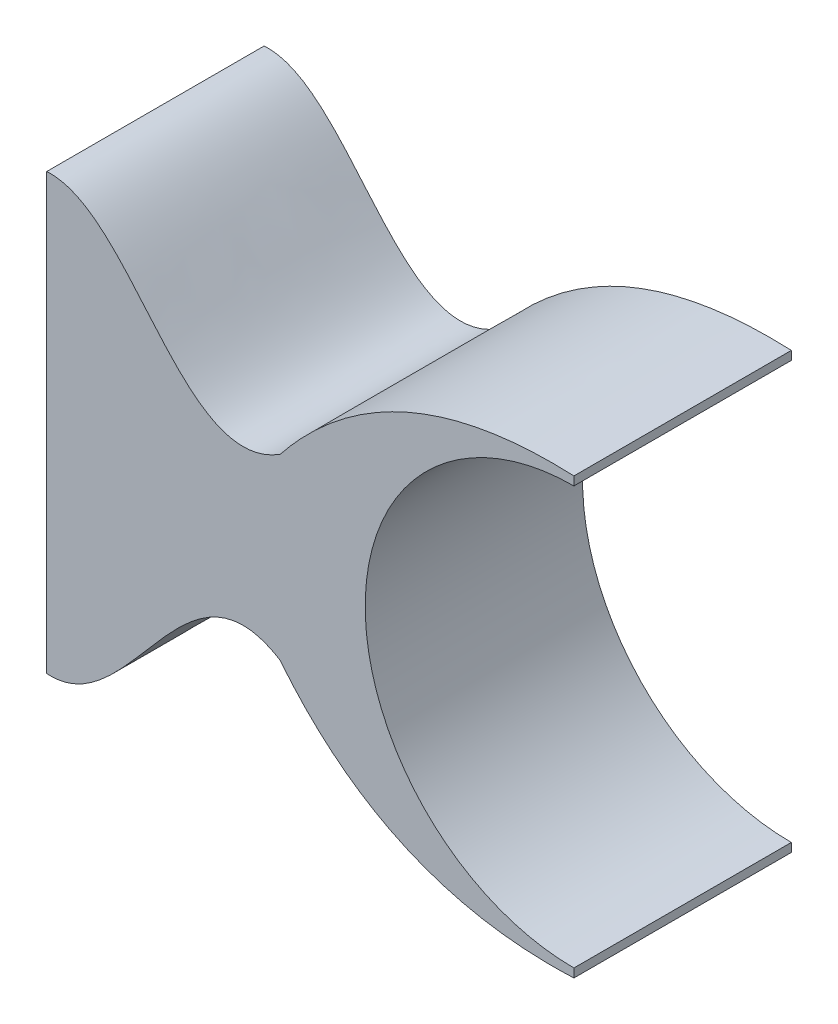
ISO-10303-21;
HEADER;
FILE_DESCRIPTION(('STEP AP214'),'2;1');
FILE_NAME('part.step','',(''),(''),'','','');
FILE_SCHEMA(('AUTOMOTIVE_DESIGN { 1 0 10303 214 1 1 1 1 }'));
ENDSEC;
DATA;
#1=APPLICATION_CONTEXT('core data for automotive mechanical design processes');
#2=APPLICATION_PROTOCOL_DEFINITION('international standard','automotive_design',2000,#1);
#3=PRODUCT_CONTEXT('',#1,'mechanical');
#4=PRODUCT('Part','Part','',(#3));
#5=PRODUCT_RELATED_PRODUCT_CATEGORY('part','',(#4));
#6=PRODUCT_DEFINITION_FORMATION('','',#4);
#7=PRODUCT_DEFINITION_CONTEXT('part definition',#1,'design');
#8=PRODUCT_DEFINITION('design','',#6,#7);
#9=PRODUCT_DEFINITION_SHAPE('','',#8);
#10=(LENGTH_UNIT() NAMED_UNIT(*) SI_UNIT(.MILLI.,.METRE.));
#11=(NAMED_UNIT(*) PLANE_ANGLE_UNIT() SI_UNIT($,.RADIAN.));
#12=(NAMED_UNIT(*) SI_UNIT($,.STERADIAN.) SOLID_ANGLE_UNIT());
#13=UNCERTAINTY_MEASURE_WITH_UNIT(LENGTH_MEASURE(1.E-05),#10,'distance_accuracy_value','');
#14=(GEOMETRIC_REPRESENTATION_CONTEXT(3) GLOBAL_UNCERTAINTY_ASSIGNED_CONTEXT((#13)) GLOBAL_UNIT_ASSIGNED_CONTEXT((#10,
#11,#12)) REPRESENTATION_CONTEXT('',''));
#15=CARTESIAN_POINT('',(0.,0.,0.));
#16=DIRECTION('',(0.,0.,1.));
#17=DIRECTION('',(1.,0.,0.));
#18=AXIS2_PLACEMENT_3D('',#15,#16,#17);
#19=CARTESIAN_POINT('',(0.,2.5,2.5));
#20=CARTESIAN_POINT('',(-2.12838134377981,2.59606487465497,2.5));
#21=CARTESIAN_POINT('',(-3.3783144735857,1.02555953711763,2.5));
#22=B_SPLINE_CURVE_WITH_KNOTS('',2,(#19,#20,#21),.UNSPECIFIED.,.F.,.F.,(3,3),(0.,1.),.UNSPECIFIED.);
#23=DIRECTION('',(0.,0.,-1.));
#24=VECTOR('',#23,1.);
#25=SURFACE_OF_LINEAR_EXTRUSION('',#22,#24);
#26=CARTESIAN_POINT('',(0.,2.5,0.));
#27=CARTESIAN_POINT('',(-2.12838134377981,2.59606487465497,0.));
#28=CARTESIAN_POINT('',(-3.3783144735857,1.02555953711763,0.));
#29=B_SPLINE_CURVE_WITH_KNOTS('',2,(#26,#27,#28),.UNSPECIFIED.,.F.,.F.,(3,3),(0.,1.),.UNSPECIFIED.);
#30=CARTESIAN_POINT('',(0.,2.5,0.));
#31=VERTEX_POINT('',#30);
#32=CARTESIAN_POINT('',(-3.3783144735857,1.02555953711763,0.));
#33=VERTEX_POINT('',#32);
#34=EDGE_CURVE('E134',#31,#33,#29,.T.);
#35=ORIENTED_EDGE('',*,*,#34,.T.);
#36=DIRECTION('',(0.,0.,-1.));
#37=VECTOR('',#36,1.);
#38=CARTESIAN_POINT('',(-3.3783144735857,1.02555953711763,2.5));
#39=LINE('',#38,#37);
#40=CARTESIAN_POINT('',(-3.3783144735857,1.02555953711763,2.5));
#41=VERTEX_POINT('',#40);
#42=EDGE_CURVE('E11',#41,#33,#39,.T.);
#43=ORIENTED_EDGE('',*,*,#42,.F.);
#44=CARTESIAN_POINT('',(0.,2.5,2.5));
#45=VERTEX_POINT('',#44);
#46=EDGE_CURVE('E168',#45,#41,#22,.T.);
#47=ORIENTED_EDGE('',*,*,#46,.F.);
#48=DIRECTION('',(0.,0.,-1.));
#49=VECTOR('',#48,1.);
#50=CARTESIAN_POINT('',(0.,2.5,2.5));
#51=LINE('',#50,#49);
#52=EDGE_CURVE('E130',#45,#31,#51,.T.);
#53=ORIENTED_EDGE('',*,*,#52,.T.);
#54=EDGE_LOOP('',(#35,#43,#47,#53));
#55=FACE_BOUND('',#54,.T.);
#56=ADVANCED_FACE('F37',(#55),#25,.F.);
#57=CARTESIAN_POINT('',(-3.3783144735857,1.02555953711763,2.5));
#58=CARTESIAN_POINT('',(-4.49216767972878,0.325238313772212,2.5));
#59=CARTESIAN_POINT('',(-5.08246023541055,2.56845581459525,2.5));
#60=CARTESIAN_POINT('',(-6.0625522393459,2.5,2.5));
#61=B_SPLINE_CURVE_WITH_KNOTS('',3,(#57,#58,#59,#60),.UNSPECIFIED.,.F.,.F.,(4,4),(0.,1.),.UNSPECIFIED.);
#62=DIRECTION('',(0.,0.,-1.));
#63=VECTOR('',#62,1.);
#64=SURFACE_OF_LINEAR_EXTRUSION('',#61,#63);
#65=CARTESIAN_POINT('',(-3.3783144735857,1.02555953711763,0.));
#66=CARTESIAN_POINT('',(-4.49216767972878,0.325238313772212,0.));
#67=CARTESIAN_POINT('',(-5.08246023541055,2.56845581459525,0.));
#68=CARTESIAN_POINT('',(-6.0625522393459,2.5,0.));
#69=B_SPLINE_CURVE_WITH_KNOTS('',3,(#65,#66,#67,#68),.UNSPECIFIED.,.F.,.F.,(4,4),(0.,1.),.UNSPECIFIED.);
#70=CARTESIAN_POINT('',(-6.0625522393459,2.5,0.));
#71=VERTEX_POINT('',#70);
#72=EDGE_CURVE('E139',#33,#71,#69,.T.);
#73=ORIENTED_EDGE('',*,*,#72,.T.);
#74=DIRECTION('',(0.,0.,-1.));
#75=VECTOR('',#74,1.);
#76=CARTESIAN_POINT('',(-6.0625522393459,2.5,2.5));
#77=LINE('',#76,#75);
#78=CARTESIAN_POINT('',(-6.0625522393459,2.5,2.5));
#79=VERTEX_POINT('',#78);
#80=EDGE_CURVE('E46',#79,#71,#77,.T.);
#81=ORIENTED_EDGE('',*,*,#80,.F.);
#82=EDGE_CURVE('E97',#41,#79,#61,.T.);
#83=ORIENTED_EDGE('',*,*,#82,.F.);
#84=ORIENTED_EDGE('',*,*,#42,.T.);
#85=EDGE_LOOP('',(#73,#81,#83,#84));
#86=FACE_BOUND('',#85,.T.);
#87=ADVANCED_FACE('F215',(#86),#64,.F.);
#88=CARTESIAN_POINT('',(-6.0625522393459,2.5,2.5));
#89=DIRECTION('',(1.,0.,0.));
#90=DIRECTION('',(0.,0.,-1.));
#91=AXIS2_PLACEMENT_3D('',#88,#89,#90);
#92=PLANE('',#91);
#93=DIRECTION('',(0.,-1.,0.));
#94=VECTOR('',#93,1.);
#95=CARTESIAN_POINT('',(-6.0625522393459,2.5,0.));
#96=LINE('',#95,#94);
#97=CARTESIAN_POINT('',(-6.0625522393459,-2.5,0.));
#98=VERTEX_POINT('',#97);
#99=EDGE_CURVE('E146',#71,#98,#96,.T.);
#100=ORIENTED_EDGE('',*,*,#99,.T.);
#101=DIRECTION('',(0.,0.,-1.));
#102=VECTOR('',#101,1.);
#103=CARTESIAN_POINT('',(-6.0625522393459,-2.5,2.5));
#104=LINE('',#103,#102);
#105=CARTESIAN_POINT('',(-6.0625522393459,-2.5,2.5));
#106=VERTEX_POINT('',#105);
#107=EDGE_CURVE('E175',#106,#98,#104,.T.);
#108=ORIENTED_EDGE('',*,*,#107,.F.);
#109=DIRECTION('',(0.,-1.,0.));
#110=VECTOR('',#109,1.);
#111=CARTESIAN_POINT('',(-6.0625522393459,2.5,2.5));
#112=LINE('',#111,#110);
#113=EDGE_CURVE('E183',#79,#106,#112,.T.);
#114=ORIENTED_EDGE('',*,*,#113,.F.);
#115=ORIENTED_EDGE('',*,*,#80,.T.);
#116=EDGE_LOOP('',(#100,#108,#114,#115));
#117=FACE_BOUND('',#116,.T.);
#118=ADVANCED_FACE('F181',(#117),#92,.F.);
#119=CARTESIAN_POINT('',(-6.0625522393459,-2.5,2.5));
#120=CARTESIAN_POINT('',(-5.08246023541055,-2.56845581459525,2.5));
#121=CARTESIAN_POINT('',(-4.49216767972878,-0.325238313772213,2.5));
#122=CARTESIAN_POINT('',(-3.3783144735857,-1.02555953711763,2.5));
#123=B_SPLINE_CURVE_WITH_KNOTS('',3,(#119,#120,#121,#122),.UNSPECIFIED.,.F.,.F.,(4,4),(0.,1.),.UNSPECIFIED.);
#124=DIRECTION('',(0.,0.,-1.));
#125=VECTOR('',#124,1.);
#126=SURFACE_OF_LINEAR_EXTRUSION('',#123,#125);
#127=CARTESIAN_POINT('',(-6.0625522393459,-2.5,0.));
#128=CARTESIAN_POINT('',(-5.08246023541055,-2.56845581459525,0.));
#129=CARTESIAN_POINT('',(-4.49216767972878,-0.325238313772213,0.));
#130=CARTESIAN_POINT('',(-3.3783144735857,-1.02555953711763,0.));
#131=B_SPLINE_CURVE_WITH_KNOTS('',3,(#127,#128,#129,#130),.UNSPECIFIED.,.F.,.F.,(4,4),(0.,1.),.UNSPECIFIED.);
#132=CARTESIAN_POINT('',(-3.3783144735857,-1.02555953711763,0.));
#133=VERTEX_POINT('',#132);
#134=EDGE_CURVE('E151',#98,#133,#131,.T.);
#135=ORIENTED_EDGE('',*,*,#134,.T.);
#136=DIRECTION('',(0.,0.,-1.));
#137=VECTOR('',#136,1.);
#138=CARTESIAN_POINT('',(-3.3783144735857,-1.02555953711763,2.5));
#139=LINE('',#138,#137);
#140=CARTESIAN_POINT('',(-3.3783144735857,-1.02555953711763,2.5));
#141=VERTEX_POINT('',#140);
#142=EDGE_CURVE('E172',#141,#133,#139,.T.);
#143=ORIENTED_EDGE('',*,*,#142,.F.);
#144=EDGE_CURVE('E195',#106,#141,#123,.T.);
#145=ORIENTED_EDGE('',*,*,#144,.F.);
#146=ORIENTED_EDGE('',*,*,#107,.T.);
#147=EDGE_LOOP('',(#135,#143,#145,#146));
#148=FACE_BOUND('',#147,.T.);
#149=ADVANCED_FACE('F191',(#148),#126,.F.);
#150=CARTESIAN_POINT('',(-3.3783144735857,-1.02555953711763,2.5));
#151=CARTESIAN_POINT('',(-2.12838134377981,-2.59606487465497,2.5));
#152=CARTESIAN_POINT('',(0.,-2.5,2.5));
#153=B_SPLINE_CURVE_WITH_KNOTS('',2,(#150,#151,#152),.UNSPECIFIED.,.F.,.F.,(3,3),(0.,1.),.UNSPECIFIED.);
#154=DIRECTION('',(0.,0.,-1.));
#155=VECTOR('',#154,1.);
#156=SURFACE_OF_LINEAR_EXTRUSION('',#153,#155);
#157=CARTESIAN_POINT('',(-3.3783144735857,-1.02555953711763,0.));
#158=CARTESIAN_POINT('',(-2.12838134377981,-2.59606487465497,0.));
#159=CARTESIAN_POINT('',(0.,-2.5,0.));
#160=B_SPLINE_CURVE_WITH_KNOTS('',2,(#157,#158,#159),.UNSPECIFIED.,.F.,.F.,(3,3),(0.,1.),.UNSPECIFIED.);
#161=CARTESIAN_POINT('',(0.,-2.5,0.));
#162=VERTEX_POINT('',#161);
#163=EDGE_CURVE('E155',#133,#162,#160,.T.);
#164=ORIENTED_EDGE('',*,*,#163,.T.);
#165=DIRECTION('',(0.,0.,-1.));
#166=VECTOR('',#165,1.);
#167=CARTESIAN_POINT('',(0.,-2.5,2.5));
#168=LINE('',#167,#166);
#169=CARTESIAN_POINT('',(0.,-2.5,2.5));
#170=VERTEX_POINT('',#169);
#171=EDGE_CURVE('E125',#170,#162,#168,.T.);
#172=ORIENTED_EDGE('',*,*,#171,.F.);
#173=EDGE_CURVE('E116',#141,#170,#153,.T.);
#174=ORIENTED_EDGE('',*,*,#173,.F.);
#175=ORIENTED_EDGE('',*,*,#142,.T.);
#176=EDGE_LOOP('',(#164,#172,#174,#175));
#177=FACE_BOUND('',#176,.T.);
#178=ADVANCED_FACE('F194',(#177),#156,.F.);
#179=CARTESIAN_POINT('',(0.,-2.5,2.5));
#180=DIRECTION('',(-1.,0.,0.));
#181=DIRECTION('',(0.,0.,1.));
#182=AXIS2_PLACEMENT_3D('',#179,#180,#181);
#183=PLANE('',#182);
#184=DIRECTION('',(0.,1.,0.));
#185=VECTOR('',#184,1.);
#186=CARTESIAN_POINT('',(0.,-2.5,0.));
#187=LINE('',#186,#185);
#188=CARTESIAN_POINT('',(0.,-2.4,0.));
#189=VERTEX_POINT('',#188);
#190=EDGE_CURVE('E124',#162,#189,#187,.T.);
#191=ORIENTED_EDGE('',*,*,#190,.T.);
#192=DIRECTION('',(0.,0.,-1.));
#193=VECTOR('',#192,1.);
#194=CARTESIAN_POINT('',(0.,-2.4,2.5));
#195=LINE('',#194,#193);
#196=CARTESIAN_POINT('',(0.,-2.4,2.5));
#197=VERTEX_POINT('',#196);
#198=EDGE_CURVE('E121',#197,#189,#195,.T.);
#199=ORIENTED_EDGE('',*,*,#198,.F.);
#200=DIRECTION('',(0.,1.,0.));
#201=VECTOR('',#200,1.);
#202=CARTESIAN_POINT('',(0.,-2.5,2.5));
#203=LINE('',#202,#201);
#204=EDGE_CURVE('E110',#170,#197,#203,.T.);
#205=ORIENTED_EDGE('',*,*,#204,.F.);
#206=ORIENTED_EDGE('',*,*,#171,.T.);
#207=EDGE_LOOP('',(#191,#199,#205,#206));
#208=FACE_BOUND('',#207,.T.);
#209=ADVANCED_FACE('F122',(#208),#183,.F.);
#210=CARTESIAN_POINT('',(0.,0.,2.5));
#211=DIRECTION('',(0.,0.,-1.));
#212=DIRECTION('',(-1.,0.,0.));
#213=AXIS2_PLACEMENT_3D('',#210,#211,#212);
#214=CYLINDRICAL_SURFACE('',#213,2.4);
#215=CARTESIAN_POINT('',(0.,0.,0.));
#216=DIRECTION('',(0.,0.,-1.));
#217=DIRECTION('',(1.,0.,0.));
#218=AXIS2_PLACEMENT_3D('',#215,#216,#217);
#219=CIRCLE('',#218,2.4);
#220=CARTESIAN_POINT('',(0.,2.4,0.));
#221=VERTEX_POINT('',#220);
#222=EDGE_CURVE('E83',#189,#221,#219,.T.);
#223=ORIENTED_EDGE('',*,*,#222,.T.);
#224=DIRECTION('',(0.,0.,-1.));
#225=VECTOR('',#224,1.);
#226=CARTESIAN_POINT('',(0.,2.4,2.5));
#227=LINE('',#226,#225);
#228=CARTESIAN_POINT('',(0.,2.4,2.5));
#229=VERTEX_POINT('',#228);
#230=EDGE_CURVE('E126',#229,#221,#227,.T.);
#231=ORIENTED_EDGE('',*,*,#230,.F.);
#232=CARTESIAN_POINT('',(0.,0.,2.5));
#233=DIRECTION('',(0.,0.,-1.));
#234=DIRECTION('',(1.,0.,0.));
#235=AXIS2_PLACEMENT_3D('',#232,#233,#234);
#236=CIRCLE('',#235,2.4);
#237=EDGE_CURVE('E114',#197,#229,#236,.T.);
#238=ORIENTED_EDGE('',*,*,#237,.F.);
#239=ORIENTED_EDGE('',*,*,#198,.T.);
#240=EDGE_LOOP('',(#223,#231,#238,#239));
#241=FACE_BOUND('',#240,.T.);
#242=ADVANCED_FACE('F128',(#241),#214,.F.);
#243=CARTESIAN_POINT('',(0.,2.5,2.5));
#244=DIRECTION('',(-1.,0.,0.));
#245=DIRECTION('',(0.,0.,1.));
#246=AXIS2_PLACEMENT_3D('',#243,#244,#245);
#247=PLANE('',#246);
#248=DIRECTION('',(0.,1.,0.));
#249=VECTOR('',#248,1.);
#250=CARTESIAN_POINT('',(0.,2.5,0.));
#251=LINE('',#250,#249);
#252=EDGE_CURVE('E89',#221,#31,#251,.T.);
#253=ORIENTED_EDGE('',*,*,#252,.T.);
#254=ORIENTED_EDGE('',*,*,#52,.F.);
#255=DIRECTION('',(0.,1.,0.));
#256=VECTOR('',#255,1.);
#257=CARTESIAN_POINT('',(0.,2.5,2.5));
#258=LINE('',#257,#256);
#259=EDGE_CURVE('E54',#229,#45,#258,.T.);
#260=ORIENTED_EDGE('',*,*,#259,.F.);
#261=ORIENTED_EDGE('',*,*,#230,.T.);
#262=EDGE_LOOP('',(#253,#254,#260,#261));
#263=FACE_BOUND('',#262,.T.);
#264=ADVANCED_FACE('F230',(#263),#247,.F.);
#265=CARTESIAN_POINT('',(-1.90876929028633,2.17942232160689,2.5));
#266=DIRECTION('',(0.,0.,-1.));
#267=DIRECTION('',(-1.,0.,0.));
#268=AXIS2_PLACEMENT_3D('',#265,#266,#267);
#269=PLANE('',#268);
#270=ORIENTED_EDGE('',*,*,#46,.T.);
#271=ORIENTED_EDGE('',*,*,#82,.T.);
#272=ORIENTED_EDGE('',*,*,#113,.T.);
#273=ORIENTED_EDGE('',*,*,#144,.T.);
#274=ORIENTED_EDGE('',*,*,#173,.T.);
#275=ORIENTED_EDGE('',*,*,#204,.T.);
#276=ORIENTED_EDGE('',*,*,#237,.T.);
#277=ORIENTED_EDGE('',*,*,#259,.T.);
#278=EDGE_LOOP('',(#270,#271,#272,#273,#274,#275,#276,#277));
#279=FACE_BOUND('',#278,.T.);
#280=ADVANCED_FACE('F112',(#279),#269,.F.);
#281=CARTESIAN_POINT('',(-1.90876929028633,2.17942232160689,0.));
#282=DIRECTION('',(0.,0.,-1.));
#283=DIRECTION('',(-1.,0.,0.));
#284=AXIS2_PLACEMENT_3D('',#281,#282,#283);
#285=PLANE('',#284);
#286=ORIENTED_EDGE('',*,*,#34,.F.);
#287=ORIENTED_EDGE('',*,*,#252,.F.);
#288=ORIENTED_EDGE('',*,*,#222,.F.);
#289=ORIENTED_EDGE('',*,*,#190,.F.);
#290=ORIENTED_EDGE('',*,*,#163,.F.);
#291=ORIENTED_EDGE('',*,*,#134,.F.);
#292=ORIENTED_EDGE('',*,*,#99,.F.);
#293=ORIENTED_EDGE('',*,*,#72,.F.);
#294=EDGE_LOOP('',(#286,#287,#288,#289,#290,#291,#292,#293));
#295=FACE_BOUND('',#294,.T.);
#296=ADVANCED_FACE('F187',(#295),#285,.T.);
#297=CLOSED_SHELL('',(#56,#87,#118,#149,#178,#209,#242,#264,#280,#296));
#298=MANIFOLD_SOLID_BREP('B2',#297);
#299=ADVANCED_BREP_SHAPE_REPRESENTATION('',(#18,#298),#14);
#300=SHAPE_DEFINITION_REPRESENTATION(#9,#299);
ENDSEC;
END-ISO-10303-21;
